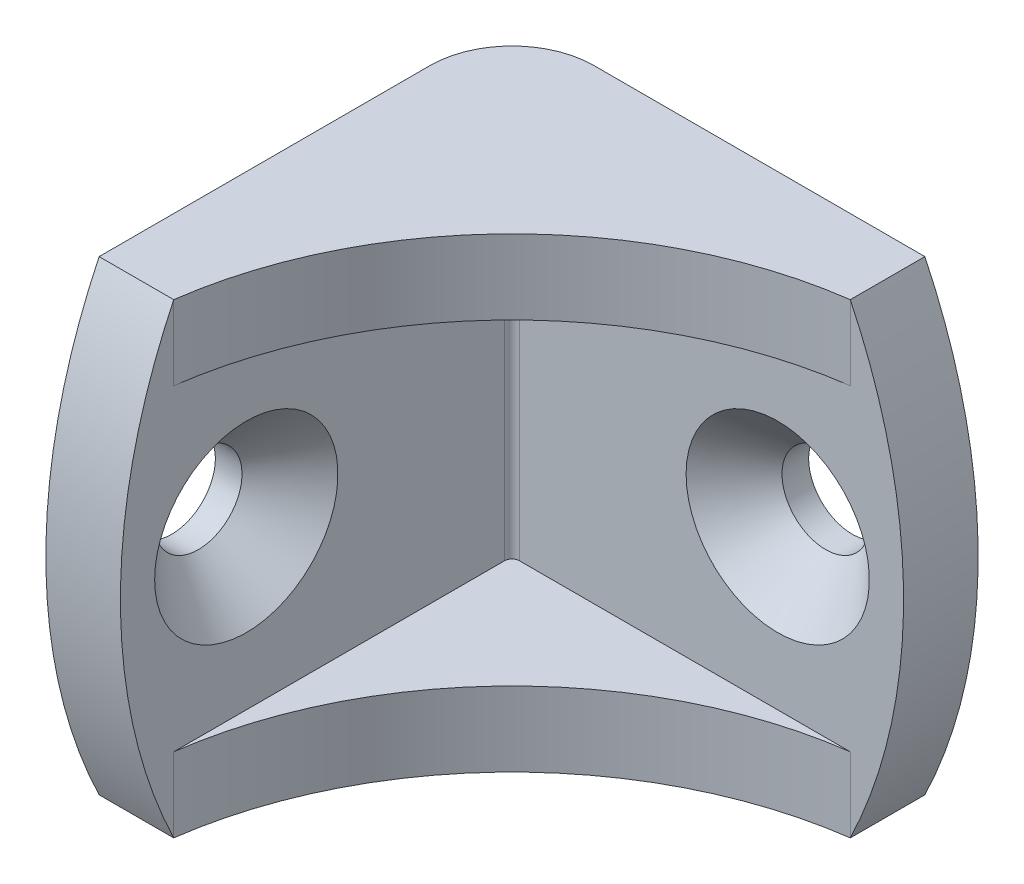
ISO-10303-21;
HEADER;
FILE_DESCRIPTION(('STEP AP214'),'2;1');
FILE_NAME('part.step','',(''),(''),'','','');
FILE_SCHEMA(('AUTOMOTIVE_DESIGN { 1 0 10303 214 1 1 1 1 }'));
ENDSEC;
DATA;
#1=APPLICATION_CONTEXT('core data for automotive mechanical design processes');
#2=APPLICATION_PROTOCOL_DEFINITION('international standard','automotive_design',2000,#1);
#3=PRODUCT_CONTEXT('',#1,'mechanical');
#4=PRODUCT('Part','Part','',(#3));
#5=PRODUCT_RELATED_PRODUCT_CATEGORY('part','',(#4));
#6=PRODUCT_DEFINITION_FORMATION('','',#4);
#7=PRODUCT_DEFINITION_CONTEXT('part definition',#1,'design');
#8=PRODUCT_DEFINITION('design','',#6,#7);
#9=PRODUCT_DEFINITION_SHAPE('','',#8);
#10=(LENGTH_UNIT() NAMED_UNIT(*) SI_UNIT(.MILLI.,.METRE.));
#11=(NAMED_UNIT(*) PLANE_ANGLE_UNIT() SI_UNIT($,.RADIAN.));
#12=(NAMED_UNIT(*) SI_UNIT($,.STERADIAN.) SOLID_ANGLE_UNIT());
#13=UNCERTAINTY_MEASURE_WITH_UNIT(LENGTH_MEASURE(1.E-05),#10,'distance_accuracy_value','');
#14=(GEOMETRIC_REPRESENTATION_CONTEXT(3) GLOBAL_UNCERTAINTY_ASSIGNED_CONTEXT((#13)) GLOBAL_UNIT_ASSIGNED_CONTEXT((#10,
#11,#12)) REPRESENTATION_CONTEXT('',''));
#15=CARTESIAN_POINT('',(0.,0.,0.));
#16=DIRECTION('',(0.,0.,1.));
#17=DIRECTION('',(1.,0.,0.));
#18=AXIS2_PLACEMENT_3D('',#15,#16,#17);
#19=CARTESIAN_POINT('',(3.9116,11.1125,3.556));
#20=DIRECTION('',(0.,0.,-1.));
#21=DIRECTION('',(-1.,0.,0.));
#22=AXIS2_PLACEMENT_3D('',#19,#20,#21);
#23=PLANE('',#22);
#24=CARTESIAN_POINT('',(16.225,0.,3.556));
#25=DIRECTION('',(0.,0.,-1.));
#26=DIRECTION('',(-1.,0.,0.));
#27=AXIS2_PLACEMENT_3D('',#24,#25,#26);
#28=CIRCLE('',#27,4.3688);
#29=CARTESIAN_POINT('',(11.8562,0.,3.556));
#30=VERTEX_POINT('',#29);
#31=EDGE_CURVE('E181',#30,#30,#28,.T.);
#32=ORIENTED_EDGE('',*,*,#31,.T.);
#33=EDGE_LOOP('',(#32));
#34=FACE_BOUND('',#33,.T.);
#35=CARTESIAN_POINT('',(-3.35359375000001,0.,3.556));
#36=DIRECTION('',(0.,0.,-1.));
#37=DIRECTION('',(-1.,0.,0.));
#38=AXIS2_PLACEMENT_3D('',#35,#36,#37);
#39=CIRCLE('',#38,25.57859375);
#40=CARTESIAN_POINT('',(19.685,11.1125,3.55600000000002));
#41=VERTEX_POINT('',#40);
#42=CARTESIAN_POINT('',(19.685,-11.1125,3.556));
#43=VERTEX_POINT('',#42);
#44=EDGE_CURVE('E113',#41,#43,#39,.T.);
#45=ORIENTED_EDGE('',*,*,#44,.F.);
#46=DIRECTION('',(0.,1.,0.));
#47=VECTOR('',#46,1.);
#48=CARTESIAN_POINT('',(19.685,7.5565,3.556));
#49=LINE('',#48,#47);
#50=CARTESIAN_POINT('',(19.685,7.5565,3.556));
#51=VERTEX_POINT('',#50);
#52=EDGE_CURVE('E126',#51,#41,#49,.T.);
#53=ORIENTED_EDGE('',*,*,#52,.F.);
#54=DIRECTION('',(-1.,0.,0.));
#55=VECTOR('',#54,1.);
#56=CARTESIAN_POINT('',(3.9116,7.5565,3.556));
#57=LINE('',#56,#55);
#58=CARTESIAN_POINT('',(3.9116,7.5565,3.556));
#59=VERTEX_POINT('',#58);
#60=EDGE_CURVE('E398',#51,#59,#57,.T.);
#61=ORIENTED_EDGE('',*,*,#60,.T.);
#62=DIRECTION('',(0.,-1.,0.));
#63=VECTOR('',#62,1.);
#64=CARTESIAN_POINT('',(3.9116,11.1125,3.556));
#65=LINE('',#64,#63);
#66=CARTESIAN_POINT('',(3.9116,-7.5565,3.556));
#67=VERTEX_POINT('',#66);
#68=EDGE_CURVE('E161',#59,#67,#65,.T.);
#69=ORIENTED_EDGE('',*,*,#68,.T.);
#70=DIRECTION('',(-1.,0.,0.));
#71=VECTOR('',#70,1.);
#72=CARTESIAN_POINT('',(3.9116,-7.5565,3.556));
#73=LINE('',#72,#71);
#74=CARTESIAN_POINT('',(19.685,-7.5565,3.556));
#75=VERTEX_POINT('',#74);
#76=EDGE_CURVE('E389',#75,#67,#73,.T.);
#77=ORIENTED_EDGE('',*,*,#76,.F.);
#78=DIRECTION('',(0.,-1.,0.));
#79=VECTOR('',#78,1.);
#80=CARTESIAN_POINT('',(19.685,-7.5565,3.556));
#81=LINE('',#80,#79);
#82=EDGE_CURVE('E128',#75,#43,#81,.T.);
#83=ORIENTED_EDGE('',*,*,#82,.T.);
#84=EDGE_LOOP('',(#45,#53,#61,#69,#77,#83));
#85=FACE_BOUND('',#84,.T.);
#86=ADVANCED_FACE('F32',(#34,#85),#23,.F.);
#87=CARTESIAN_POINT('',(3.9116,11.1125,0.));
#88=DIRECTION('',(0.,0.,-1.));
#89=DIRECTION('',(-1.,0.,0.));
#90=AXIS2_PLACEMENT_3D('',#87,#88,#89);
#91=PLANE('',#90);
#92=CARTESIAN_POINT('',(16.225,0.,0.));
#93=DIRECTION('',(0.,0.,-1.));
#94=DIRECTION('',(-1.,0.,0.));
#95=AXIS2_PLACEMENT_3D('',#92,#93,#94);
#96=CIRCLE('',#95,2.0828);
#97=CARTESIAN_POINT('',(14.1422,0.,0.));
#98=VERTEX_POINT('',#97);
#99=EDGE_CURVE('E130',#98,#98,#96,.T.);
#100=ORIENTED_EDGE('',*,*,#99,.F.);
#101=EDGE_LOOP('',(#100));
#102=FACE_BOUND('',#101,.T.);
#103=DIRECTION('',(1.,0.,0.));
#104=VECTOR('',#103,1.);
#105=CARTESIAN_POINT('',(3.9116,11.1125,0.));
#106=LINE('',#105,#104);
#107=CARTESIAN_POINT('',(3.9116,11.1125,0.));
#108=VERTEX_POINT('',#107);
#109=CARTESIAN_POINT('',(19.685,11.1125,0.));
#110=VERTEX_POINT('',#109);
#111=EDGE_CURVE('E153',#108,#110,#106,.T.);
#112=ORIENTED_EDGE('',*,*,#111,.T.);
#113=CARTESIAN_POINT('',(-3.35359374999999,0.,0.));
#114=DIRECTION('',(0.,0.,-1.));
#115=DIRECTION('',(-1.,0.,0.));
#116=AXIS2_PLACEMENT_3D('',#113,#114,#115);
#117=CIRCLE('',#116,25.57859375);
#118=CARTESIAN_POINT('',(19.685,-11.1125,0.));
#119=VERTEX_POINT('',#118);
#120=EDGE_CURVE('E115',#110,#119,#117,.T.);
#121=ORIENTED_EDGE('',*,*,#120,.T.);
#122=DIRECTION('',(1.,0.,0.));
#123=VECTOR('',#122,1.);
#124=CARTESIAN_POINT('',(3.9116,-11.1125,0.));
#125=LINE('',#124,#123);
#126=CARTESIAN_POINT('',(3.9116,-11.1125,0.));
#127=VERTEX_POINT('',#126);
#128=EDGE_CURVE('E147',#127,#119,#125,.T.);
#129=ORIENTED_EDGE('',*,*,#128,.F.);
#130=DIRECTION('',(0.,-1.,0.));
#131=VECTOR('',#130,1.);
#132=CARTESIAN_POINT('',(3.9116,11.1125,0.));
#133=LINE('',#132,#131);
#134=EDGE_CURVE('E176',#108,#127,#133,.T.);
#135=ORIENTED_EDGE('',*,*,#134,.F.);
#136=EDGE_LOOP('',(#112,#121,#129,#135));
#137=FACE_BOUND('',#136,.T.);
#138=ADVANCED_FACE('F201',(#102,#137),#91,.T.);
#139=CARTESIAN_POINT('',(3.9116,11.1125,3.9116));
#140=DIRECTION('',(0.,-1.,0.));
#141=DIRECTION('',(-1.,0.,0.));
#142=AXIS2_PLACEMENT_3D('',#139,#140,#141);
#143=PLANE('',#142);
#144=DIRECTION('',(0.,0.,-1.));
#145=VECTOR('',#144,1.);
#146=CARTESIAN_POINT('',(19.6849999999998,11.1125,51.6745364977729));
#147=LINE('',#146,#145);
#148=EDGE_CURVE('E109',#41,#110,#147,.T.);
#149=ORIENTED_EDGE('',*,*,#148,.T.);
#150=ORIENTED_EDGE('',*,*,#111,.F.);
#151=CARTESIAN_POINT('',(3.9116,11.1125,3.9116));
#152=DIRECTION('',(0.,-1.,0.));
#153=DIRECTION('',(0.,0.,1.));
#154=AXIS2_PLACEMENT_3D('',#151,#152,#153);
#155=CIRCLE('',#154,3.9116);
#156=CARTESIAN_POINT('',(0.,11.1125,3.9116));
#157=VERTEX_POINT('',#156);
#158=EDGE_CURVE('E155',#157,#108,#155,.T.);
#159=ORIENTED_EDGE('',*,*,#158,.F.);
#160=DIRECTION('',(0.,0.,-1.));
#161=VECTOR('',#160,1.);
#162=CARTESIAN_POINT('',(0.,11.1125,22.225));
#163=LINE('',#162,#161);
#164=CARTESIAN_POINT('',(0.,11.1125,19.685));
#165=VERTEX_POINT('',#164);
#166=EDGE_CURVE('E159',#165,#157,#163,.T.);
#167=ORIENTED_EDGE('',*,*,#166,.F.);
#168=DIRECTION('',(-1.,0.,0.));
#169=VECTOR('',#168,1.);
#170=CARTESIAN_POINT('',(51.6745364977729,11.1125,19.685));
#171=LINE('',#170,#169);
#172=CARTESIAN_POINT('',(3.556,11.1125,19.685));
#173=VERTEX_POINT('',#172);
#174=EDGE_CURVE('E136',#173,#165,#171,.T.);
#175=ORIENTED_EDGE('',*,*,#174,.F.);
#176=CARTESIAN_POINT('',(22.225,11.1125,22.225));
#177=DIRECTION('',(0.,-1.,0.));
#178=DIRECTION('',(0.,0.,-1.));
#179=AXIS2_PLACEMENT_3D('',#176,#177,#178);
#180=CIRCLE('',#179,18.8409968154554);
#181=EDGE_CURVE('E133',#173,#41,#180,.T.);
#182=ORIENTED_EDGE('',*,*,#181,.T.);
#183=EDGE_LOOP('',(#149,#150,#159,#167,#175,#182));
#184=FACE_BOUND('',#183,.T.);
#185=ADVANCED_FACE('F134',(#184),#143,.F.);
#186=CARTESIAN_POINT('',(3.9116,-11.1125,3.9116));
#187=DIRECTION('',(0.,-1.,0.));
#188=DIRECTION('',(-1.,0.,0.));
#189=AXIS2_PLACEMENT_3D('',#186,#187,#188);
#190=PLANE('',#189);
#191=ORIENTED_EDGE('',*,*,#128,.T.);
#192=DIRECTION('',(0.,0.,-1.));
#193=VECTOR('',#192,1.);
#194=CARTESIAN_POINT('',(19.6849999999998,-11.1125,51.6745364977729));
#195=LINE('',#194,#193);
#196=EDGE_CURVE('E179',#119,#43,#195,.F.);
#197=ORIENTED_EDGE('',*,*,#196,.T.);
#198=CARTESIAN_POINT('',(22.225,-11.1125,22.225));
#199=DIRECTION('',(0.,-1.,0.));
#200=DIRECTION('',(0.,0.,-1.));
#201=AXIS2_PLACEMENT_3D('',#198,#199,#200);
#202=CIRCLE('',#201,18.8409968154554);
#203=CARTESIAN_POINT('',(3.556,-11.1125,19.685));
#204=VERTEX_POINT('',#203);
#205=EDGE_CURVE('E379',#204,#43,#202,.T.);
#206=ORIENTED_EDGE('',*,*,#205,.F.);
#207=DIRECTION('',(-1.,0.,0.));
#208=VECTOR('',#207,1.);
#209=CARTESIAN_POINT('',(51.6745364977729,-11.1125,19.685));
#210=LINE('',#209,#208);
#211=CARTESIAN_POINT('',(0.,-11.1125,19.685));
#212=VERTEX_POINT('',#211);
#213=EDGE_CURVE('E55',#212,#204,#210,.F.);
#214=ORIENTED_EDGE('',*,*,#213,.F.);
#215=DIRECTION('',(0.,0.,-1.));
#216=VECTOR('',#215,1.);
#217=CARTESIAN_POINT('',(0.,-11.1125,22.225));
#218=LINE('',#217,#216);
#219=CARTESIAN_POINT('',(0.,-11.1125,3.9116));
#220=VERTEX_POINT('',#219);
#221=EDGE_CURVE('E156',#212,#220,#218,.T.);
#222=ORIENTED_EDGE('',*,*,#221,.T.);
#223=CARTESIAN_POINT('',(3.9116,-11.1125,3.9116));
#224=DIRECTION('',(0.,-1.,0.));
#225=DIRECTION('',(0.,0.,1.));
#226=AXIS2_PLACEMENT_3D('',#223,#224,#225);
#227=CIRCLE('',#226,3.9116);
#228=EDGE_CURVE('E164',#220,#127,#227,.T.);
#229=ORIENTED_EDGE('',*,*,#228,.T.);
#230=EDGE_LOOP('',(#191,#197,#206,#214,#222,#229));
#231=FACE_BOUND('',#230,.T.);
#232=ADVANCED_FACE('F221',(#231),#190,.T.);
#233=CARTESIAN_POINT('',(3.556,11.1125,22.225));
#234=DIRECTION('',(-1.,0.,0.));
#235=DIRECTION('',(0.,0.,1.));
#236=AXIS2_PLACEMENT_3D('',#233,#234,#235);
#237=PLANE('',#236);
#238=CARTESIAN_POINT('',(3.556,0.,16.225));
#239=DIRECTION('',(-1.,0.,0.));
#240=DIRECTION('',(0.,0.,1.));
#241=AXIS2_PLACEMENT_3D('',#238,#239,#240);
#242=CIRCLE('',#241,4.3688);
#243=CARTESIAN_POINT('',(3.556,0.,20.5938));
#244=VERTEX_POINT('',#243);
#245=EDGE_CURVE('E11',#244,#244,#242,.T.);
#246=ORIENTED_EDGE('',*,*,#245,.T.);
#247=EDGE_LOOP('',(#246));
#248=FACE_BOUND('',#247,.T.);
#249=CARTESIAN_POINT('',(3.556,0.,-3.35359374999999));
#250=DIRECTION('',(-1.,0.,0.));
#251=DIRECTION('',(0.,0.,1.));
#252=AXIS2_PLACEMENT_3D('',#249,#250,#251);
#253=CIRCLE('',#252,25.57859375);
#254=EDGE_CURVE('E370',#173,#204,#253,.F.);
#255=ORIENTED_EDGE('',*,*,#254,.T.);
#256=DIRECTION('',(0.,-1.,0.));
#257=VECTOR('',#256,1.);
#258=CARTESIAN_POINT('',(3.556,-7.5565,19.685));
#259=LINE('',#258,#257);
#260=CARTESIAN_POINT('',(3.556,-7.5565,19.685));
#261=VERTEX_POINT('',#260);
#262=EDGE_CURVE('E392',#261,#204,#259,.T.);
#263=ORIENTED_EDGE('',*,*,#262,.F.);
#264=DIRECTION('',(0.,0.,1.));
#265=VECTOR('',#264,1.);
#266=CARTESIAN_POINT('',(3.556,-7.5565,19.685));
#267=LINE('',#266,#265);
#268=CARTESIAN_POINT('',(3.556,-7.5565,3.9116));
#269=VERTEX_POINT('',#268);
#270=EDGE_CURVE('E383',#269,#261,#267,.T.);
#271=ORIENTED_EDGE('',*,*,#270,.F.);
#272=DIRECTION('',(0.,-1.,0.));
#273=VECTOR('',#272,1.);
#274=CARTESIAN_POINT('',(3.556,11.1125,3.9116));
#275=LINE('',#274,#273);
#276=CARTESIAN_POINT('',(3.556,7.5565,3.9116));
#277=VERTEX_POINT('',#276);
#278=EDGE_CURVE('E170',#277,#269,#275,.T.);
#279=ORIENTED_EDGE('',*,*,#278,.F.);
#280=DIRECTION('',(0.,0.,1.));
#281=VECTOR('',#280,1.);
#282=CARTESIAN_POINT('',(3.556,7.5565,19.685));
#283=LINE('',#282,#281);
#284=CARTESIAN_POINT('',(3.556,7.5565,19.685));
#285=VERTEX_POINT('',#284);
#286=EDGE_CURVE('E145',#277,#285,#283,.T.);
#287=ORIENTED_EDGE('',*,*,#286,.T.);
#288=DIRECTION('',(0.,1.,0.));
#289=VECTOR('',#288,1.);
#290=CARTESIAN_POINT('',(3.556,7.5565,19.685));
#291=LINE('',#290,#289);
#292=EDGE_CURVE('E144',#285,#173,#291,.T.);
#293=ORIENTED_EDGE('',*,*,#292,.T.);
#294=EDGE_LOOP('',(#255,#263,#271,#279,#287,#293));
#295=FACE_BOUND('',#294,.T.);
#296=ADVANCED_FACE('F218',(#248,#295),#237,.F.);
#297=CARTESIAN_POINT('',(0.,11.1125,22.225));
#298=DIRECTION('',(-1.,0.,0.));
#299=DIRECTION('',(0.,0.,1.));
#300=AXIS2_PLACEMENT_3D('',#297,#298,#299);
#301=PLANE('',#300);
#302=CARTESIAN_POINT('',(0.,0.,-3.35359374999999));
#303=DIRECTION('',(-1.,0.,0.));
#304=DIRECTION('',(0.,0.,1.));
#305=AXIS2_PLACEMENT_3D('',#302,#303,#304);
#306=CIRCLE('',#305,25.57859375);
#307=EDGE_CURVE('E47',#165,#212,#306,.F.);
#308=ORIENTED_EDGE('',*,*,#307,.F.);
#309=ORIENTED_EDGE('',*,*,#166,.T.);
#310=DIRECTION('',(0.,-1.,0.));
#311=VECTOR('',#310,1.);
#312=CARTESIAN_POINT('',(0.,11.1125,3.9116));
#313=LINE('',#312,#311);
#314=EDGE_CURVE('E173',#157,#220,#313,.T.);
#315=ORIENTED_EDGE('',*,*,#314,.T.);
#316=ORIENTED_EDGE('',*,*,#221,.F.);
#317=EDGE_LOOP('',(#308,#309,#315,#316));
#318=FACE_BOUND('',#317,.T.);
#319=CARTESIAN_POINT('',(0.,0.,16.225));
#320=DIRECTION('',(1.,0.,0.));
#321=DIRECTION('',(0.,0.,-1.));
#322=AXIS2_PLACEMENT_3D('',#319,#320,#321);
#323=CIRCLE('',#322,2.0828);
#324=CARTESIAN_POINT('',(0.,0.,14.1422));
#325=VERTEX_POINT('',#324);
#326=EDGE_CURVE('E375',#325,#325,#323,.T.);
#327=ORIENTED_EDGE('',*,*,#326,.T.);
#328=EDGE_LOOP('',(#327));
#329=FACE_BOUND('',#328,.T.);
#330=ADVANCED_FACE('F214',(#318,#329),#301,.T.);
#331=CARTESIAN_POINT('',(3.9116,11.1125,3.9116));
#332=DIRECTION('',(0.,-1.,0.));
#333=DIRECTION('',(0.,0.,-1.));
#334=AXIS2_PLACEMENT_3D('',#331,#332,#333);
#335=CYLINDRICAL_SURFACE('',#334,3.9116);
#336=ORIENTED_EDGE('',*,*,#228,.F.);
#337=ORIENTED_EDGE('',*,*,#314,.F.);
#338=ORIENTED_EDGE('',*,*,#158,.T.);
#339=ORIENTED_EDGE('',*,*,#134,.T.);
#340=EDGE_LOOP('',(#336,#337,#338,#339));
#341=FACE_BOUND('',#340,.T.);
#342=ADVANCED_FACE('F210',(#341),#335,.T.);
#343=CARTESIAN_POINT('',(3.9116,11.1125,3.9116));
#344=DIRECTION('',(0.,-1.,0.));
#345=DIRECTION('',(0.,0.,-1.));
#346=AXIS2_PLACEMENT_3D('',#343,#344,#345);
#347=CYLINDRICAL_SURFACE('',#346,0.3556);
#348=ORIENTED_EDGE('',*,*,#278,.T.);
#349=CARTESIAN_POINT('',(3.9116,-7.5565,3.9116));
#350=DIRECTION('',(0.,1.,0.));
#351=DIRECTION('',(0.,0.,1.));
#352=AXIS2_PLACEMENT_3D('',#349,#350,#351);
#353=CIRCLE('',#352,0.3556);
#354=EDGE_CURVE('E386',#67,#269,#353,.T.);
#355=ORIENTED_EDGE('',*,*,#354,.F.);
#356=ORIENTED_EDGE('',*,*,#68,.F.);
#357=CARTESIAN_POINT('',(3.9116,7.5565,3.9116));
#358=DIRECTION('',(0.,1.,0.));
#359=DIRECTION('',(0.,0.,1.));
#360=AXIS2_PLACEMENT_3D('',#357,#358,#359);
#361=CIRCLE('',#360,0.3556);
#362=EDGE_CURVE('E150',#59,#277,#361,.T.);
#363=ORIENTED_EDGE('',*,*,#362,.T.);
#364=EDGE_LOOP('',(#348,#355,#356,#363));
#365=FACE_BOUND('',#364,.T.);
#366=ADVANCED_FACE('F213',(#365),#347,.F.);
#367=CARTESIAN_POINT('',(22.225,7.5565,22.225));
#368=DIRECTION('',(0.,1.,0.));
#369=DIRECTION('',(0.,0.,1.));
#370=AXIS2_PLACEMENT_3D('',#367,#368,#369);
#371=CYLINDRICAL_SURFACE('',#370,18.8409968154554);
#372=ORIENTED_EDGE('',*,*,#181,.F.);
#373=ORIENTED_EDGE('',*,*,#292,.F.);
#374=CARTESIAN_POINT('',(22.225,7.5565,22.225));
#375=DIRECTION('',(0.,-1.,0.));
#376=DIRECTION('',(0.,0.,-1.));
#377=AXIS2_PLACEMENT_3D('',#374,#375,#376);
#378=CIRCLE('',#377,18.8409968154554);
#379=EDGE_CURVE('E139',#285,#51,#378,.T.);
#380=ORIENTED_EDGE('',*,*,#379,.T.);
#381=ORIENTED_EDGE('',*,*,#52,.T.);
#382=EDGE_LOOP('',(#372,#373,#380,#381));
#383=FACE_BOUND('',#382,.T.);
#384=ADVANCED_FACE('F142',(#383),#371,.F.);
#385=CARTESIAN_POINT('',(22.225,7.5565,22.225));
#386=DIRECTION('',(0.,-1.,0.));
#387=DIRECTION('',(0.,0.,-1.));
#388=AXIS2_PLACEMENT_3D('',#385,#386,#387);
#389=PLANE('',#388);
#390=ORIENTED_EDGE('',*,*,#379,.F.);
#391=ORIENTED_EDGE('',*,*,#286,.F.);
#392=ORIENTED_EDGE('',*,*,#362,.F.);
#393=ORIENTED_EDGE('',*,*,#60,.F.);
#394=EDGE_LOOP('',(#390,#391,#392,#393));
#395=FACE_BOUND('',#394,.T.);
#396=ADVANCED_FACE('F232',(#395),#389,.T.);
#397=CARTESIAN_POINT('',(22.225,-7.5565,22.225));
#398=DIRECTION('',(0.,-1.,0.));
#399=DIRECTION('',(0.,0.,-1.));
#400=AXIS2_PLACEMENT_3D('',#397,#398,#399);
#401=CYLINDRICAL_SURFACE('',#400,18.8409968154554);
#402=ORIENTED_EDGE('',*,*,#205,.T.);
#403=ORIENTED_EDGE('',*,*,#82,.F.);
#404=CARTESIAN_POINT('',(22.225,-7.5565,22.225));
#405=DIRECTION('',(0.,-1.,0.));
#406=DIRECTION('',(0.,0.,-1.));
#407=AXIS2_PLACEMENT_3D('',#404,#405,#406);
#408=CIRCLE('',#407,18.8409968154554);
#409=EDGE_CURVE('E380',#261,#75,#408,.T.);
#410=ORIENTED_EDGE('',*,*,#409,.F.);
#411=ORIENTED_EDGE('',*,*,#262,.T.);
#412=EDGE_LOOP('',(#402,#403,#410,#411));
#413=FACE_BOUND('',#412,.T.);
#414=ADVANCED_FACE('F235',(#413),#401,.F.);
#415=CARTESIAN_POINT('',(22.225,-7.5565,22.225));
#416=DIRECTION('',(0.,1.,0.));
#417=DIRECTION('',(0.,0.,-1.));
#418=AXIS2_PLACEMENT_3D('',#415,#416,#417);
#419=PLANE('',#418);
#420=ORIENTED_EDGE('',*,*,#409,.T.);
#421=ORIENTED_EDGE('',*,*,#76,.T.);
#422=ORIENTED_EDGE('',*,*,#354,.T.);
#423=ORIENTED_EDGE('',*,*,#270,.T.);
#424=EDGE_LOOP('',(#420,#421,#422,#423));
#425=FACE_BOUND('',#424,.T.);
#426=ADVANCED_FACE('F239',(#425),#419,.T.);
#427=CARTESIAN_POINT('',(22.225,0.,16.225));
#428=DIRECTION('',(-1.,0.,0.));
#429=DIRECTION('',(0.,0.,1.));
#430=AXIS2_PLACEMENT_3D('',#427,#428,#429);
#431=CYLINDRICAL_SURFACE('',#430,2.0828);
#432=CARTESIAN_POINT('',(1.27000000000001,0.,16.225));
#433=DIRECTION('',(-1.,0.,0.));
#434=DIRECTION('',(0.,0.,1.));
#435=AXIS2_PLACEMENT_3D('',#432,#433,#434);
#436=CIRCLE('',#435,2.0828);
#437=CARTESIAN_POINT('',(1.27000000000001,0.,18.3078));
#438=VERTEX_POINT('',#437);
#439=EDGE_CURVE('E40',#438,#438,#436,.F.);
#440=ORIENTED_EDGE('',*,*,#439,.T.);
#441=EDGE_LOOP('',(#440));
#442=FACE_BOUND('',#441,.T.);
#443=ORIENTED_EDGE('',*,*,#326,.F.);
#444=EDGE_LOOP('',(#443));
#445=FACE_BOUND('',#444,.T.);
#446=ADVANCED_FACE('F189',(#442,#445),#431,.F.);
#447=CARTESIAN_POINT('',(51.6745364977729,0.,-3.35359374999999));
#448=DIRECTION('',(-1.,0.,0.));
#449=DIRECTION('',(0.,0.,1.));
#450=AXIS2_PLACEMENT_3D('',#447,#448,#449);
#451=CYLINDRICAL_SURFACE('',#450,25.57859375);
#452=ORIENTED_EDGE('',*,*,#213,.T.);
#453=ORIENTED_EDGE('',*,*,#254,.F.);
#454=ORIENTED_EDGE('',*,*,#174,.T.);
#455=ORIENTED_EDGE('',*,*,#307,.T.);
#456=EDGE_LOOP('',(#452,#453,#454,#455));
#457=FACE_BOUND('',#456,.T.);
#458=ADVANCED_FACE('F246',(#457),#451,.T.);
#459=CARTESIAN_POINT('',(16.2249999999999,0.,22.2250000000001));
#460=DIRECTION('',(0.,0.,-1.));
#461=DIRECTION('',(-1.,0.,0.));
#462=AXIS2_PLACEMENT_3D('',#459,#460,#461);
#463=CYLINDRICAL_SURFACE('',#462,2.0828);
#464=CARTESIAN_POINT('',(16.225,0.,1.26999999999999));
#465=DIRECTION('',(0.,0.,-1.));
#466=DIRECTION('',(-1.,0.,0.));
#467=AXIS2_PLACEMENT_3D('',#464,#465,#466);
#468=CIRCLE('',#467,2.0828);
#469=CARTESIAN_POINT('',(14.1422,0.,1.26999999999998));
#470=VERTEX_POINT('',#469);
#471=EDGE_CURVE('E184',#470,#470,#468,.F.);
#472=ORIENTED_EDGE('',*,*,#471,.T.);
#473=EDGE_LOOP('',(#472));
#474=FACE_BOUND('',#473,.T.);
#475=ORIENTED_EDGE('',*,*,#99,.T.);
#476=EDGE_LOOP('',(#475));
#477=FACE_BOUND('',#476,.T.);
#478=ADVANCED_FACE('F249',(#474,#477),#463,.F.);
#479=CARTESIAN_POINT('',(-3.35359375000018,0.,51.6745364977729));
#480=DIRECTION('',(0.,0.,-1.));
#481=DIRECTION('',(-1.,0.,0.));
#482=AXIS2_PLACEMENT_3D('',#479,#480,#481);
#483=CYLINDRICAL_SURFACE('',#482,25.57859375);
#484=ORIENTED_EDGE('',*,*,#148,.F.);
#485=ORIENTED_EDGE('',*,*,#44,.T.);
#486=ORIENTED_EDGE('',*,*,#196,.F.);
#487=ORIENTED_EDGE('',*,*,#120,.F.);
#488=EDGE_LOOP('',(#484,#485,#486,#487));
#489=FACE_BOUND('',#488,.T.);
#490=ADVANCED_FACE('F111',(#489),#483,.T.);
#491=CARTESIAN_POINT('',(16.225,0.,3.556));
#492=DIRECTION('',(0.,0.,1.));
#493=DIRECTION('',(1.,0.,0.));
#494=AXIS2_PLACEMENT_3D('',#491,#492,#493);
#495=CONICAL_SURFACE('',#494,4.36879999999999,0.785398163397445);
#496=ORIENTED_EDGE('',*,*,#471,.F.);
#497=EDGE_LOOP('',(#496));
#498=FACE_BOUND('',#497,.T.);
#499=ORIENTED_EDGE('',*,*,#31,.F.);
#500=EDGE_LOOP('',(#499));
#501=FACE_BOUND('',#500,.T.);
#502=ADVANCED_FACE('F193',(#498,#501),#495,.F.);
#503=CARTESIAN_POINT('',(1.27000000000001,0.,16.225));
#504=DIRECTION('',(1.,0.,0.));
#505=DIRECTION('',(0.,0.,-1.));
#506=AXIS2_PLACEMENT_3D('',#503,#504,#505);
#507=CONICAL_SURFACE('',#506,2.0828,0.785398163397451);
#508=ORIENTED_EDGE('',*,*,#245,.F.);
#509=EDGE_LOOP('',(#508));
#510=FACE_BOUND('',#509,.T.);
#511=ORIENTED_EDGE('',*,*,#439,.F.);
#512=EDGE_LOOP('',(#511));
#513=FACE_BOUND('',#512,.T.);
#514=ADVANCED_FACE('F34',(#510,#513),#507,.F.);
#515=CLOSED_SHELL('',(#86,#138,#185,#232,#296,#330,#342,#366,#384,#396,#414,#426,#446,#458,#478,
#490,#502,#514));
#516=MANIFOLD_SOLID_BREP('B2',#515);
#517=ADVANCED_BREP_SHAPE_REPRESENTATION('',(#18,#516),#14);
#518=SHAPE_DEFINITION_REPRESENTATION(#9,#517);
ENDSEC;
END-ISO-10303-21;
